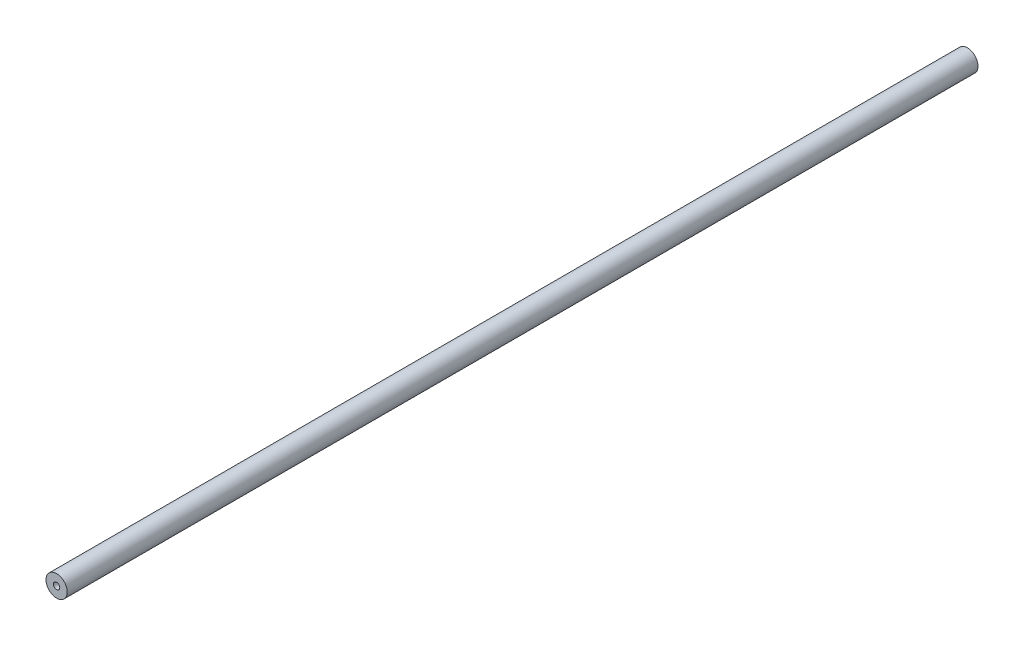
ISO-10303-21;
HEADER;
FILE_DESCRIPTION(('STEP AP214'),'2;1');
FILE_NAME('part.step','',(''),(''),'','','');
FILE_SCHEMA(('AUTOMOTIVE_DESIGN { 1 0 10303 214 1 1 1 1 }'));
ENDSEC;
DATA;
#1=APPLICATION_CONTEXT('core data for automotive mechanical design processes');
#2=APPLICATION_PROTOCOL_DEFINITION('international standard','automotive_design',2000,#1);
#3=PRODUCT_CONTEXT('',#1,'mechanical');
#4=PRODUCT('Part','Part','',(#3));
#5=PRODUCT_RELATED_PRODUCT_CATEGORY('part','',(#4));
#6=PRODUCT_DEFINITION_FORMATION('','',#4);
#7=PRODUCT_DEFINITION_CONTEXT('part definition',#1,'design');
#8=PRODUCT_DEFINITION('design','',#6,#7);
#9=PRODUCT_DEFINITION_SHAPE('','',#8);
#10=(LENGTH_UNIT() NAMED_UNIT(*) SI_UNIT(.MILLI.,.METRE.));
#11=(NAMED_UNIT(*) PLANE_ANGLE_UNIT() SI_UNIT($,.RADIAN.));
#12=(NAMED_UNIT(*) SI_UNIT($,.STERADIAN.) SOLID_ANGLE_UNIT());
#13=UNCERTAINTY_MEASURE_WITH_UNIT(LENGTH_MEASURE(1.E-05),#10,'distance_accuracy_value','');
#14=(GEOMETRIC_REPRESENTATION_CONTEXT(3) GLOBAL_UNCERTAINTY_ASSIGNED_CONTEXT((#13)) GLOBAL_UNIT_ASSIGNED_CONTEXT((#10,
#11,#12)) REPRESENTATION_CONTEXT('',''));
#15=CARTESIAN_POINT('',(0.,0.,0.));
#16=DIRECTION('',(0.,0.,1.));
#17=DIRECTION('',(1.,0.,0.));
#18=AXIS2_PLACEMENT_3D('',#15,#16,#17);
#19=CARTESIAN_POINT('',(0.,0.,548.24));
#20=DIRECTION('',(0.,0.,-1.));
#21=DIRECTION('',(-1.,0.,0.));
#22=AXIS2_PLACEMENT_3D('',#19,#20,#21);
#23=CYLINDRICAL_SURFACE('',#22,6.4);
#24=CARTESIAN_POINT('',(0.,0.,548.24));
#25=DIRECTION('',(0.,0.,1.));
#26=DIRECTION('',(1.,0.,0.));
#27=AXIS2_PLACEMENT_3D('',#24,#25,#26);
#28=CIRCLE('',#27,6.4);
#29=CARTESIAN_POINT('',(6.4,0.,548.24));
#30=VERTEX_POINT('',#29);
#31=EDGE_CURVE('E11',#30,#30,#28,.T.);
#32=ORIENTED_EDGE('',*,*,#31,.F.);
#33=EDGE_LOOP('',(#32));
#34=FACE_BOUND('',#33,.T.);
#35=CARTESIAN_POINT('',(0.,0.,0.));
#36=DIRECTION('',(0.,0.,1.));
#37=DIRECTION('',(1.,0.,0.));
#38=AXIS2_PLACEMENT_3D('',#35,#36,#37);
#39=CIRCLE('',#38,6.4);
#40=CARTESIAN_POINT('',(6.4,0.,0.));
#41=VERTEX_POINT('',#40);
#42=EDGE_CURVE('E38',#41,#41,#39,.T.);
#43=ORIENTED_EDGE('',*,*,#42,.T.);
#44=EDGE_LOOP('',(#43));
#45=FACE_BOUND('',#44,.T.);
#46=ADVANCED_FACE('F35',(#34,#45),#23,.T.);
#47=CARTESIAN_POINT('',(0.,0.,548.24));
#48=DIRECTION('',(0.,0.,1.));
#49=DIRECTION('',(1.,0.,0.));
#50=AXIS2_PLACEMENT_3D('',#47,#48,#49);
#51=PLANE('',#50);
#52=CARTESIAN_POINT('',(0.,0.,548.24));
#53=DIRECTION('',(0.,0.,1.));
#54=DIRECTION('',(1.,0.,0.));
#55=AXIS2_PLACEMENT_3D('',#52,#53,#54);
#56=CIRCLE('',#55,1.89865);
#57=CARTESIAN_POINT('',(1.89865,0.,548.24));
#58=VERTEX_POINT('',#57);
#59=EDGE_CURVE('E59',#58,#58,#56,.T.);
#60=ORIENTED_EDGE('',*,*,#59,.F.);
#61=EDGE_LOOP('',(#60));
#62=FACE_BOUND('',#61,.T.);
#63=ORIENTED_EDGE('',*,*,#31,.T.);
#64=EDGE_LOOP('',(#63));
#65=FACE_BOUND('',#64,.T.);
#66=ADVANCED_FACE('F77',(#62,#65),#51,.T.);
#67=CARTESIAN_POINT('',(0.,0.,0.));
#68=DIRECTION('',(0.,0.,1.));
#69=DIRECTION('',(1.,0.,0.));
#70=AXIS2_PLACEMENT_3D('',#67,#68,#69);
#71=PLANE('',#70);
#72=CARTESIAN_POINT('',(0.,0.,0.));
#73=DIRECTION('',(0.,0.,-1.));
#74=DIRECTION('',(-1.,0.,0.));
#75=AXIS2_PLACEMENT_3D('',#72,#73,#74);
#76=CIRCLE('',#75,1.89865);
#77=CARTESIAN_POINT('',(-1.89865,0.,0.));
#78=VERTEX_POINT('',#77);
#79=EDGE_CURVE('E58',#78,#78,#76,.T.);
#80=ORIENTED_EDGE('',*,*,#79,.F.);
#81=EDGE_LOOP('',(#80));
#82=FACE_BOUND('',#81,.T.);
#83=ORIENTED_EDGE('',*,*,#42,.F.);
#84=EDGE_LOOP('',(#83));
#85=FACE_BOUND('',#84,.T.);
#86=ADVANCED_FACE('F74',(#82,#85),#71,.F.);
#87=CARTESIAN_POINT('',(0.,0.,12.83));
#88=DIRECTION('',(0.,0.,-1.));
#89=DIRECTION('',(-1.,0.,0.));
#90=AXIS2_PLACEMENT_3D('',#87,#88,#89);
#91=CONICAL_SURFACE('',#90,1.89864999999999,1.02974425867665);
#92=CARTESIAN_POINT('',(0.,0.,13.9708240143167));
#93=VERTEX_POINT('',#92);
#94=VERTEX_LOOP('',#93);
#95=FACE_BOUND('',#94,.T.);
#96=CARTESIAN_POINT('',(0.,0.,12.83));
#97=DIRECTION('',(0.,0.,-1.));
#98=DIRECTION('',(-1.,0.,0.));
#99=AXIS2_PLACEMENT_3D('',#96,#97,#98);
#100=CIRCLE('',#99,1.89864999999999);
#101=CARTESIAN_POINT('',(-1.89864999999999,0.,12.83));
#102=VERTEX_POINT('',#101);
#103=EDGE_CURVE('E62',#102,#102,#100,.T.);
#104=ORIENTED_EDGE('',*,*,#103,.T.);
#105=EDGE_LOOP('',(#104));
#106=FACE_BOUND('',#105,.T.);
#107=ADVANCED_FACE('F76',(#95,#106),#91,.F.);
#108=CARTESIAN_POINT('',(0.,0.,0.));
#109=DIRECTION('',(0.,0.,-1.));
#110=DIRECTION('',(-1.,0.,0.));
#111=AXIS2_PLACEMENT_3D('',#108,#109,#110);
#112=CYLINDRICAL_SURFACE('',#111,1.89865);
#113=ORIENTED_EDGE('',*,*,#103,.F.);
#114=EDGE_LOOP('',(#113));
#115=FACE_BOUND('',#114,.T.);
#116=ORIENTED_EDGE('',*,*,#79,.T.);
#117=EDGE_LOOP('',(#116));
#118=FACE_BOUND('',#117,.T.);
#119=ADVANCED_FACE('F52',(#115,#118),#112,.F.);
#120=CARTESIAN_POINT('',(0.,0.,535.41));
#121=DIRECTION('',(0.,0.,1.));
#122=DIRECTION('',(1.,0.,0.));
#123=AXIS2_PLACEMENT_3D('',#120,#121,#122);
#124=CONICAL_SURFACE('',#123,1.89864999999999,1.02974425867664);
#125=CARTESIAN_POINT('',(0.,0.,534.269175985683));
#126=VERTEX_POINT('',#125);
#127=VERTEX_LOOP('',#126);
#128=FACE_BOUND('',#127,.T.);
#129=CARTESIAN_POINT('',(0.,0.,535.41));
#130=DIRECTION('',(0.,0.,1.));
#131=DIRECTION('',(1.,0.,0.));
#132=AXIS2_PLACEMENT_3D('',#129,#130,#131);
#133=CIRCLE('',#132,1.89864999999999);
#134=CARTESIAN_POINT('',(1.89864999999999,0.,535.41));
#135=VERTEX_POINT('',#134);
#136=EDGE_CURVE('E56',#135,#135,#133,.T.);
#137=ORIENTED_EDGE('',*,*,#136,.T.);
#138=EDGE_LOOP('',(#137));
#139=FACE_BOUND('',#138,.T.);
#140=ADVANCED_FACE('F48',(#128,#139),#124,.F.);
#141=CARTESIAN_POINT('',(0.,0.,548.24));
#142=DIRECTION('',(0.,0.,1.));
#143=DIRECTION('',(1.,0.,0.));
#144=AXIS2_PLACEMENT_3D('',#141,#142,#143);
#145=CYLINDRICAL_SURFACE('',#144,1.89865);
#146=ORIENTED_EDGE('',*,*,#136,.F.);
#147=EDGE_LOOP('',(#146));
#148=FACE_BOUND('',#147,.T.);
#149=ORIENTED_EDGE('',*,*,#59,.T.);
#150=EDGE_LOOP('',(#149));
#151=FACE_BOUND('',#150,.T.);
#152=ADVANCED_FACE('F51',(#148,#151),#145,.F.);
#153=CLOSED_SHELL('',(#46,#66,#86,#107,#119,#140,#152));
#154=MANIFOLD_SOLID_BREP('B2',#153);
#155=ADVANCED_BREP_SHAPE_REPRESENTATION('',(#18,#154),#14);
#156=SHAPE_DEFINITION_REPRESENTATION(#9,#155);
ENDSEC;
END-ISO-10303-21;
